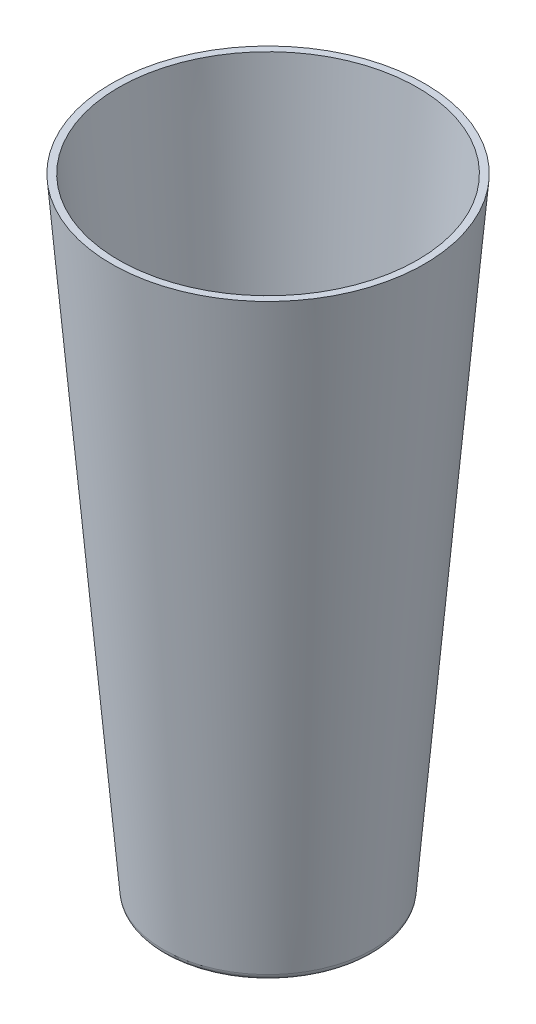
ISO-10303-21;
HEADER;
FILE_DESCRIPTION(('STEP AP214'),'2;1');
FILE_NAME('part.step','',(''),(''),'','','');
FILE_SCHEMA(('AUTOMOTIVE_DESIGN { 1 0 10303 214 1 1 1 1 }'));
ENDSEC;
DATA;
#1=APPLICATION_CONTEXT('core data for automotive mechanical design processes');
#2=APPLICATION_PROTOCOL_DEFINITION('international standard','automotive_design',2000,#1);
#3=PRODUCT_CONTEXT('',#1,'mechanical');
#4=PRODUCT('Part','Part','',(#3));
#5=PRODUCT_RELATED_PRODUCT_CATEGORY('part','',(#4));
#6=PRODUCT_DEFINITION_FORMATION('','',#4);
#7=PRODUCT_DEFINITION_CONTEXT('part definition',#1,'design');
#8=PRODUCT_DEFINITION('design','',#6,#7);
#9=PRODUCT_DEFINITION_SHAPE('','',#8);
#10=(LENGTH_UNIT() NAMED_UNIT(*) SI_UNIT(.MILLI.,.METRE.));
#11=(NAMED_UNIT(*) PLANE_ANGLE_UNIT() SI_UNIT($,.RADIAN.));
#12=(NAMED_UNIT(*) SI_UNIT($,.STERADIAN.) SOLID_ANGLE_UNIT());
#13=UNCERTAINTY_MEASURE_WITH_UNIT(LENGTH_MEASURE(1.E-05),#10,'distance_accuracy_value','');
#14=(GEOMETRIC_REPRESENTATION_CONTEXT(3) GLOBAL_UNCERTAINTY_ASSIGNED_CONTEXT((#13)) GLOBAL_UNIT_ASSIGNED_CONTEXT((#10,
#11,#12)) REPRESENTATION_CONTEXT('',''));
#15=CARTESIAN_POINT('',(0.,0.,0.));
#16=DIRECTION('',(0.,0.,1.));
#17=DIRECTION('',(1.,0.,0.));
#18=AXIS2_PLACEMENT_3D('',#15,#16,#17);
#19=CARTESIAN_POINT('',(0.,24.00000003,-36.3194684762359));
#20=DIRECTION('',(0.,-1.,0.));
#21=DIRECTION('',(1.,0.,0.));
#22=AXIS2_PLACEMENT_3D('',#19,#20,#21);
#23=PLANE('',#22);
#24=CARTESIAN_POINT('',(0.,24.00000003,0.));
#25=DIRECTION('',(0.,1.,0.));
#26=DIRECTION('',(-1.,0.,0.));
#27=AXIS2_PLACEMENT_3D('',#24,#25,#26);
#28=CIRCLE('',#27,36.3194684762359);
#29=CARTESIAN_POINT('',(-36.3194684762359,24.00000003,0.));
#30=VERTEX_POINT('',#29);
#31=EDGE_CURVE('E50',#30,#30,#28,.T.);
#32=ORIENTED_EDGE('',*,*,#31,.T.);
#33=EDGE_LOOP('',(#32));
#34=FACE_BOUND('',#33,.T.);
#35=ADVANCED_FACE('F39',(#34),#23,.F.);
#36=CARTESIAN_POINT('',(0.,-96.,0.));
#37=DIRECTION('',(0.,1.,0.));
#38=DIRECTION('',(-1.,0.,0.));
#39=AXIS2_PLACEMENT_3D('',#36,#37,#38);
#40=PLANE('',#39);
#41=CARTESIAN_POINT('',(0.,-96.,0.));
#42=DIRECTION('',(0.,1.,0.));
#43=DIRECTION('',(-1.,0.,0.));
#44=AXIS2_PLACEMENT_3D('',#41,#42,#43);
#45=CIRCLE('',#44,24.4792027106039);
#46=CARTESIAN_POINT('',(-24.4792027106038,-96.,0.));
#47=VERTEX_POINT('',#46);
#48=EDGE_CURVE('E11',#47,#47,#45,.F.);
#49=ORIENTED_EDGE('',*,*,#48,.T.);
#50=EDGE_LOOP('',(#49));
#51=FACE_BOUND('',#50,.T.);
#52=ADVANCED_FACE('F60',(#51),#40,.F.);
#53=CARTESIAN_POINT('',(0.,-96.,0.));
#54=DIRECTION('',(0.,1.,0.));
#55=DIRECTION('',(-1.,0.,0.));
#56=AXIS2_PLACEMENT_3D('',#53,#54,#55);
#57=CONICAL_SURFACE('',#56,26.3194684737359,0.0831412318884412);
#58=CARTESIAN_POINT('',(0.,-94.1660909597075,0.));
#59=DIRECTION('',(0.,-1.,0.));
#60=DIRECTION('',(1.,0.,0.));
#61=AXIS2_PLACEMENT_3D('',#58,#59,#60);
#62=CIRCLE('',#61,26.4722942270936);
#63=CARTESIAN_POINT('',(26.4722942270936,-94.1660909597075,0.));
#64=VERTEX_POINT('',#63);
#65=EDGE_CURVE('E46',#64,#64,#62,.F.);
#66=ORIENTED_EDGE('',*,*,#65,.T.);
#67=EDGE_LOOP('',(#66));
#68=FACE_BOUND('',#67,.T.);
#69=ORIENTED_EDGE('',*,*,#31,.F.);
#70=EDGE_LOOP('',(#69));
#71=FACE_BOUND('',#70,.T.);
#72=ADVANCED_FACE('F58',(#68,#71),#57,.T.);
#73=CARTESIAN_POINT('',(0.,-94.,0.));
#74=DIRECTION('',(0.,1.,0.));
#75=DIRECTION('',(-1.,0.,0.));
#76=AXIS2_PLACEMENT_3D('',#73,#74,#75);
#77=TOROIDAL_SURFACE('',#76,24.4792027106039,2.);
#78=ORIENTED_EDGE('',*,*,#48,.F.);
#79=EDGE_LOOP('',(#78));
#80=FACE_BOUND('',#79,.T.);
#81=ORIENTED_EDGE('',*,*,#65,.F.);
#82=EDGE_LOOP('',(#81));
#83=FACE_BOUND('',#82,.T.);
#84=ADVANCED_FACE('F41',(#80,#83),#77,.T.);
#85=CLOSED_SHELL('',(#35,#52,#72,#84));
#86=MANIFOLD_SOLID_BREP('B2',#85);
#87=CARTESIAN_POINT('',(0.,-100.,0.));
#88=DIRECTION('',(0.,1.,0.));
#89=DIRECTION('',(-1.,0.,0.));
#90=AXIS2_PLACEMENT_3D('',#87,#88,#89);
#91=CONICAL_SURFACE('',#90,30.,0.0831412318884412);
#92=CARTESIAN_POINT('',(0.,-98.1660909597074,0.));
#93=DIRECTION('',(0.,-1.,0.));
#94=DIRECTION('',(1.,0.,0.));
#95=AXIS2_PLACEMENT_3D('',#92,#93,#94);
#96=CIRCLE('',#95,30.1528257533577);
#97=CARTESIAN_POINT('',(30.1528257533577,-98.1660909597074,0.));
#98=VERTEX_POINT('',#97);
#99=EDGE_CURVE('E110',#98,#98,#96,.F.);
#100=ORIENTED_EDGE('',*,*,#99,.T.);
#101=EDGE_LOOP('',(#100));
#102=FACE_BOUND('',#101,.T.);
#103=CARTESIAN_POINT('',(0.,80.,0.));
#104=DIRECTION('',(0.,1.,0.));
#105=DIRECTION('',(-1.,0.,0.));
#106=AXIS2_PLACEMENT_3D('',#103,#104,#105);
#107=CIRCLE('',#106,45.);
#108=CARTESIAN_POINT('',(-45.,80.,0.));
#109=VERTEX_POINT('',#108);
#110=EDGE_CURVE('E115',#109,#109,#107,.T.);
#111=ORIENTED_EDGE('',*,*,#110,.F.);
#112=EDGE_LOOP('',(#111));
#113=FACE_BOUND('',#112,.T.);
#114=ADVANCED_FACE('F95',(#102,#113),#91,.T.);
#115=CARTESIAN_POINT('',(0.,80.,0.));
#116=DIRECTION('',(0.,-1.,0.));
#117=DIRECTION('',(1.,0.,0.));
#118=AXIS2_PLACEMENT_3D('',#115,#116,#117);
#119=PLANE('',#118);
#120=CARTESIAN_POINT('',(0.,80.,0.));
#121=DIRECTION('',(0.,-1.,0.));
#122=DIRECTION('',(1.,0.,0.));
#123=AXIS2_PLACEMENT_3D('',#120,#121,#122);
#124=CIRCLE('',#123,42.9930675702013);
#125=CARTESIAN_POINT('',(42.9930675702013,80.,0.));
#126=VERTEX_POINT('',#125);
#127=EDGE_CURVE('E118',#126,#126,#124,.F.);
#128=ORIENTED_EDGE('',*,*,#127,.F.);
#129=EDGE_LOOP('',(#128));
#130=FACE_BOUND('',#129,.T.);
#131=ORIENTED_EDGE('',*,*,#110,.T.);
#132=EDGE_LOOP('',(#131));
#133=FACE_BOUND('',#132,.T.);
#134=ADVANCED_FACE('F124',(#130,#133),#119,.F.);
#135=CARTESIAN_POINT('',(0.,-100.,0.));
#136=DIRECTION('',(0.,1.,0.));
#137=DIRECTION('',(-1.,0.,0.));
#138=AXIS2_PLACEMENT_3D('',#135,#136,#137);
#139=PLANE('',#138);
#140=CARTESIAN_POINT('',(0.,-100.,0.));
#141=DIRECTION('',(0.,1.,0.));
#142=DIRECTION('',(-1.,0.,0.));
#143=AXIS2_PLACEMENT_3D('',#140,#141,#142);
#144=CIRCLE('',#143,28.159734236868);
#145=CARTESIAN_POINT('',(-28.1597342368679,-100.,0.));
#146=VERTEX_POINT('',#145);
#147=EDGE_CURVE('E106',#146,#146,#144,.F.);
#148=ORIENTED_EDGE('',*,*,#147,.T.);
#149=EDGE_LOOP('',(#148));
#150=FACE_BOUND('',#149,.T.);
#151=ADVANCED_FACE('F127',(#150),#139,.F.);
#152=CARTESIAN_POINT('',(0.,-99.8339090402925,0.));
#153=DIRECTION('',(0.,1.,0.));
#154=DIRECTION('',(-1.,0.,0.));
#155=AXIS2_PLACEMENT_3D('',#152,#153,#154);
#156=CONICAL_SURFACE('',#155,28.0069084835102,0.0831412318884412);
#157=CARTESIAN_POINT('',(0.,-96.1660909597075,0.));
#158=DIRECTION('',(0.,1.,0.));
#159=DIRECTION('',(-1.,0.,0.));
#160=AXIS2_PLACEMENT_3D('',#157,#158,#159);
#161=CIRCLE('',#160,28.3125599902257);
#162=CARTESIAN_POINT('',(-28.3125599902256,-96.1660909597075,0.));
#163=VERTEX_POINT('',#162);
#164=EDGE_CURVE('E38',#163,#163,#161,.F.);
#165=ORIENTED_EDGE('',*,*,#164,.T.);
#166=EDGE_LOOP('',(#165));
#167=FACE_BOUND('',#166,.T.);
#168=ORIENTED_EDGE('',*,*,#127,.T.);
#169=EDGE_LOOP('',(#168));
#170=FACE_BOUND('',#169,.T.);
#171=ADVANCED_FACE('F122',(#167,#170),#156,.F.);
#172=CARTESIAN_POINT('',(0.,-98.,0.));
#173=DIRECTION('',(0.,1.,0.));
#174=DIRECTION('',(-1.,0.,0.));
#175=AXIS2_PLACEMENT_3D('',#172,#173,#174);
#176=PLANE('',#175);
#177=CARTESIAN_POINT('',(0.,-98.,0.));
#178=DIRECTION('',(0.,1.,0.));
#179=DIRECTION('',(-1.,0.,0.));
#180=AXIS2_PLACEMENT_3D('',#177,#178,#179);
#181=CIRCLE('',#180,26.3194684737359);
#182=CARTESIAN_POINT('',(-26.3194684737359,-98.,0.));
#183=VERTEX_POINT('',#182);
#184=EDGE_CURVE('E102',#183,#183,#181,.T.);
#185=ORIENTED_EDGE('',*,*,#184,.T.);
#186=EDGE_LOOP('',(#185));
#187=FACE_BOUND('',#186,.T.);
#188=ADVANCED_FACE('F139',(#187),#176,.T.);
#189=CARTESIAN_POINT('',(0.,-98.,0.));
#190=DIRECTION('',(0.,1.,0.));
#191=DIRECTION('',(-1.,0.,0.));
#192=AXIS2_PLACEMENT_3D('',#189,#190,#191);
#193=TOROIDAL_SURFACE('',#192,28.159734236868,2.);
#194=ORIENTED_EDGE('',*,*,#147,.F.);
#195=EDGE_LOOP('',(#194));
#196=FACE_BOUND('',#195,.T.);
#197=ORIENTED_EDGE('',*,*,#99,.F.);
#198=EDGE_LOOP('',(#197));
#199=FACE_BOUND('',#198,.T.);
#200=ADVANCED_FACE('F137',(#196,#199),#193,.T.);
#201=CARTESIAN_POINT('',(0.,-96.,0.));
#202=DIRECTION('',(0.,1.,0.));
#203=DIRECTION('',(-1.,0.,0.));
#204=AXIS2_PLACEMENT_3D('',#201,#202,#203);
#205=TOROIDAL_SURFACE('',#204,26.3194684737359,2.);
#206=ORIENTED_EDGE('',*,*,#164,.F.);
#207=EDGE_LOOP('',(#206));
#208=FACE_BOUND('',#207,.T.);
#209=ORIENTED_EDGE('',*,*,#184,.F.);
#210=EDGE_LOOP('',(#209));
#211=FACE_BOUND('',#210,.T.);
#212=ADVANCED_FACE('F97',(#208,#211),#205,.F.);
#213=CLOSED_SHELL('',(#114,#134,#151,#171,#188,#200,#212));
#214=MANIFOLD_SOLID_BREP('B6',#213);
#215=ADVANCED_BREP_SHAPE_REPRESENTATION('',(#18,#86,#214),#14);
#216=SHAPE_DEFINITION_REPRESENTATION(#9,#215);
ENDSEC;
END-ISO-10303-21;
